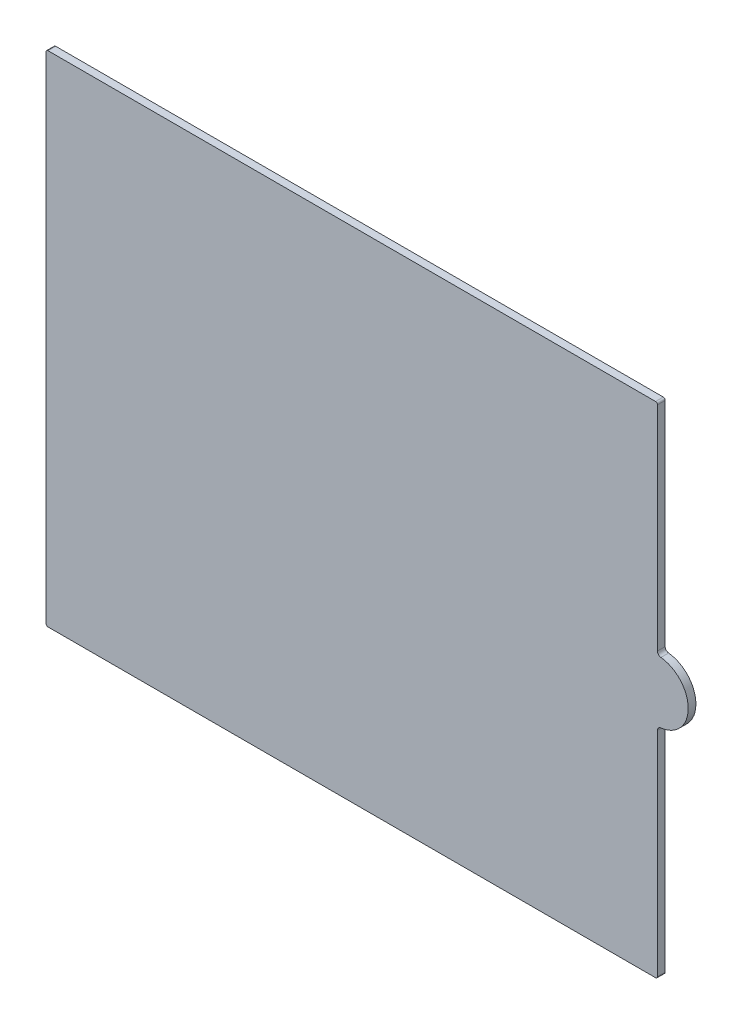
ISO-10303-21;
HEADER;
FILE_DESCRIPTION(('STEP AP214'),'2;1');
FILE_NAME('part.step','',(''),(''),'','','');
FILE_SCHEMA(('AUTOMOTIVE_DESIGN { 1 0 10303 214 1 1 1 1 }'));
ENDSEC;
DATA;
#1=APPLICATION_CONTEXT('core data for automotive mechanical design processes');
#2=APPLICATION_PROTOCOL_DEFINITION('international standard','automotive_design',2000,#1);
#3=PRODUCT_CONTEXT('',#1,'mechanical');
#4=PRODUCT('Part','Part','',(#3));
#5=PRODUCT_RELATED_PRODUCT_CATEGORY('part','',(#4));
#6=PRODUCT_DEFINITION_FORMATION('','',#4);
#7=PRODUCT_DEFINITION_CONTEXT('part definition',#1,'design');
#8=PRODUCT_DEFINITION('design','',#6,#7);
#9=PRODUCT_DEFINITION_SHAPE('','',#8);
#10=(LENGTH_UNIT() NAMED_UNIT(*) SI_UNIT(.MILLI.,.METRE.));
#11=(NAMED_UNIT(*) PLANE_ANGLE_UNIT() SI_UNIT($,.RADIAN.));
#12=(NAMED_UNIT(*) SI_UNIT($,.STERADIAN.) SOLID_ANGLE_UNIT());
#13=UNCERTAINTY_MEASURE_WITH_UNIT(LENGTH_MEASURE(1.E-05),#10,'distance_accuracy_value','');
#14=(GEOMETRIC_REPRESENTATION_CONTEXT(3) GLOBAL_UNCERTAINTY_ASSIGNED_CONTEXT((#13)) GLOBAL_UNIT_ASSIGNED_CONTEXT((#10,
#11,#12)) REPRESENTATION_CONTEXT('',''));
#15=CARTESIAN_POINT('',(0.,0.,0.));
#16=DIRECTION('',(0.,0.,1.));
#17=DIRECTION('',(1.,0.,0.));
#18=AXIS2_PLACEMENT_3D('',#15,#16,#17);
#19=CARTESIAN_POINT('',(252.73,103.1494,3.175));
#20=DIRECTION('',(0.,0.,-1.));
#21=DIRECTION('',(-1.,0.,0.));
#22=AXIS2_PLACEMENT_3D('',#19,#20,#21);
#23=CYLINDRICAL_SURFACE('',#22,12.7);
#24=CARTESIAN_POINT('',(252.73,103.1494,3.175));
#25=DIRECTION('',(0.,0.,1.));
#26=DIRECTION('',(1.,0.,0.));
#27=AXIS2_PLACEMENT_3D('',#24,#25,#26);
#28=CIRCLE('',#27,12.7);
#29=CARTESIAN_POINT('',(254.141111111111,90.5280385270012,3.175));
#30=VERTEX_POINT('',#29);
#31=CARTESIAN_POINT('',(254.141111111111,115.770761472999,3.175));
#32=VERTEX_POINT('',#31);
#33=EDGE_CURVE('E156',#30,#32,#28,.T.);
#34=ORIENTED_EDGE('',*,*,#33,.F.);
#35=DIRECTION('',(0.,0.,-1.));
#36=VECTOR('',#35,1.);
#37=CARTESIAN_POINT('',(254.141111111111,90.5280385270012,3.175));
#38=LINE('',#37,#36);
#39=CARTESIAN_POINT('',(254.141111111111,90.5280385270012,0.));
#40=VERTEX_POINT('',#39);
#41=EDGE_CURVE('E213',#30,#40,#38,.T.);
#42=ORIENTED_EDGE('',*,*,#41,.T.);
#43=CARTESIAN_POINT('',(252.73,103.1494,0.));
#44=DIRECTION('',(0.,0.,1.));
#45=DIRECTION('',(1.,0.,0.));
#46=AXIS2_PLACEMENT_3D('',#43,#44,#45);
#47=CIRCLE('',#46,12.7);
#48=CARTESIAN_POINT('',(254.141111111111,115.770761472999,0.));
#49=VERTEX_POINT('',#48);
#50=EDGE_CURVE('E230',#40,#49,#47,.T.);
#51=ORIENTED_EDGE('',*,*,#50,.T.);
#52=DIRECTION('',(0.,0.,-1.));
#53=VECTOR('',#52,1.);
#54=CARTESIAN_POINT('',(254.141111111111,115.770761472999,3.175));
#55=LINE('',#54,#53);
#56=EDGE_CURVE('E210',#49,#32,#55,.F.);
#57=ORIENTED_EDGE('',*,*,#56,.T.);
#58=EDGE_LOOP('',(#34,#42,#51,#57));
#59=FACE_BOUND('',#58,.T.);
#60=ADVANCED_FACE('F38',(#59),#23,.T.);
#61=CARTESIAN_POINT('',(252.73,115.8494,3.175));
#62=DIRECTION('',(-1.,0.,0.));
#63=DIRECTION('',(0.,0.,1.));
#64=AXIS2_PLACEMENT_3D('',#61,#62,#63);
#65=PLANE('',#64);
#66=DIRECTION('',(0.,1.,0.));
#67=VECTOR('',#66,1.);
#68=CARTESIAN_POINT('',(252.73,115.8494,3.175));
#69=LINE('',#68,#67);
#70=CARTESIAN_POINT('',(252.73,117.348431657124,3.175));
#71=VERTEX_POINT('',#70);
#72=CARTESIAN_POINT('',(252.73,205.50505,3.175));
#73=VERTEX_POINT('',#72);
#74=EDGE_CURVE('E161',#71,#73,#69,.T.);
#75=ORIENTED_EDGE('',*,*,#74,.F.);
#76=DIRECTION('',(0.,0.,1.));
#77=VECTOR('',#76,1.);
#78=CARTESIAN_POINT('',(252.73,117.348431657124,0.));
#79=LINE('',#78,#77);
#80=CARTESIAN_POINT('',(252.73,117.348431657124,0.));
#81=VERTEX_POINT('',#80);
#82=EDGE_CURVE('E220',#71,#81,#79,.F.);
#83=ORIENTED_EDGE('',*,*,#82,.T.);
#84=DIRECTION('',(0.,1.,0.));
#85=VECTOR('',#84,1.);
#86=CARTESIAN_POINT('',(252.73,115.8494,0.));
#87=LINE('',#86,#85);
#88=CARTESIAN_POINT('',(252.73,205.50505,0.));
#89=VERTEX_POINT('',#88);
#90=EDGE_CURVE('E231',#81,#89,#87,.T.);
#91=ORIENTED_EDGE('',*,*,#90,.T.);
#92=DIRECTION('',(0.,0.,-1.));
#93=VECTOR('',#92,1.);
#94=CARTESIAN_POINT('',(252.73,205.50505,3.175));
#95=LINE('',#94,#93);
#96=EDGE_CURVE('E206',#89,#73,#95,.F.);
#97=ORIENTED_EDGE('',*,*,#96,.T.);
#98=EDGE_LOOP('',(#75,#83,#91,#97));
#99=FACE_BOUND('',#98,.T.);
#100=ADVANCED_FACE('F238',(#99),#65,.F.);
#101=CARTESIAN_POINT('',(252.73,206.2988,3.175));
#102=DIRECTION('',(0.,-1.,0.));
#103=DIRECTION('',(1.,0.,0.));
#104=AXIS2_PLACEMENT_3D('',#101,#102,#103);
#105=PLANE('',#104);
#106=DIRECTION('',(-1.,0.,0.));
#107=VECTOR('',#106,1.);
#108=CARTESIAN_POINT('',(252.73,206.2988,0.));
#109=LINE('',#108,#107);
#110=CARTESIAN_POINT('',(251.93625,206.2988,0.));
#111=VERTEX_POINT('',#110);
#112=CARTESIAN_POINT('',(0.793749999999982,206.2988,0.));
#113=VERTEX_POINT('',#112);
#114=EDGE_CURVE('E260',#111,#113,#109,.T.);
#115=ORIENTED_EDGE('',*,*,#114,.T.);
#116=DIRECTION('',(0.,0.,-1.));
#117=VECTOR('',#116,1.);
#118=CARTESIAN_POINT('',(0.793749999999982,206.2988,3.175));
#119=LINE('',#118,#117);
#120=CARTESIAN_POINT('',(0.793749999999982,206.2988,3.175));
#121=VERTEX_POINT('',#120);
#122=EDGE_CURVE('E203',#113,#121,#119,.F.);
#123=ORIENTED_EDGE('',*,*,#122,.T.);
#124=DIRECTION('',(-1.,0.,0.));
#125=VECTOR('',#124,1.);
#126=CARTESIAN_POINT('',(252.73,206.2988,3.175));
#127=LINE('',#126,#125);
#128=CARTESIAN_POINT('',(251.93625,206.2988,3.175));
#129=VERTEX_POINT('',#128);
#130=EDGE_CURVE('E242',#129,#121,#127,.T.);
#131=ORIENTED_EDGE('',*,*,#130,.F.);
#132=DIRECTION('',(0.,0.,-1.));
#133=VECTOR('',#132,1.);
#134=CARTESIAN_POINT('',(251.93625,206.2988,3.175));
#135=LINE('',#134,#133);
#136=EDGE_CURVE('E199',#129,#111,#135,.T.);
#137=ORIENTED_EDGE('',*,*,#136,.T.);
#138=EDGE_LOOP('',(#115,#123,#131,#137));
#139=FACE_BOUND('',#138,.T.);
#140=ADVANCED_FACE('F286',(#139),#105,.F.);
#141=CARTESIAN_POINT('',(0.,206.2988,3.175));
#142=DIRECTION('',(1.,0.,0.));
#143=DIRECTION('',(0.,0.,-1.));
#144=AXIS2_PLACEMENT_3D('',#141,#142,#143);
#145=PLANE('',#144);
#146=DIRECTION('',(0.,-1.,0.));
#147=VECTOR('',#146,1.);
#148=CARTESIAN_POINT('',(0.,206.2988,0.));
#149=LINE('',#148,#147);
#150=CARTESIAN_POINT('',(0.,205.50505,0.));
#151=VERTEX_POINT('',#150);
#152=CARTESIAN_POINT('',(0.,0.79375000000001,0.));
#153=VERTEX_POINT('',#152);
#154=EDGE_CURVE('E163',#151,#153,#149,.T.);
#155=ORIENTED_EDGE('',*,*,#154,.T.);
#156=DIRECTION('',(0.,0.,-1.));
#157=VECTOR('',#156,1.);
#158=CARTESIAN_POINT('',(0.,0.79375000000001,3.175));
#159=LINE('',#158,#157);
#160=CARTESIAN_POINT('',(0.,0.79375000000001,3.175));
#161=VERTEX_POINT('',#160);
#162=EDGE_CURVE('E196',#153,#161,#159,.F.);
#163=ORIENTED_EDGE('',*,*,#162,.T.);
#164=DIRECTION('',(0.,-1.,0.));
#165=VECTOR('',#164,1.);
#166=CARTESIAN_POINT('',(0.,206.2988,3.175));
#167=LINE('',#166,#165);
#168=CARTESIAN_POINT('',(0.,205.50505,3.175));
#169=VERTEX_POINT('',#168);
#170=EDGE_CURVE('E246',#169,#161,#167,.T.);
#171=ORIENTED_EDGE('',*,*,#170,.F.);
#172=DIRECTION('',(0.,0.,-1.));
#173=VECTOR('',#172,1.);
#174=CARTESIAN_POINT('',(0.,205.50505,3.175));
#175=LINE('',#174,#173);
#176=EDGE_CURVE('E192',#169,#151,#175,.T.);
#177=ORIENTED_EDGE('',*,*,#176,.T.);
#178=EDGE_LOOP('',(#155,#163,#171,#177));
#179=FACE_BOUND('',#178,.T.);
#180=ADVANCED_FACE('F268',(#179),#145,.F.);
#181=CARTESIAN_POINT('',(0.,0.,3.175));
#182=DIRECTION('',(0.,1.,0.));
#183=DIRECTION('',(0.,0.,1.));
#184=AXIS2_PLACEMENT_3D('',#181,#182,#183);
#185=PLANE('',#184);
#186=DIRECTION('',(1.,0.,0.));
#187=VECTOR('',#186,1.);
#188=CARTESIAN_POINT('',(0.,0.,0.));
#189=LINE('',#188,#187);
#190=CARTESIAN_POINT('',(0.79375,0.,0.));
#191=VERTEX_POINT('',#190);
#192=CARTESIAN_POINT('',(251.93625,0.,0.));
#193=VERTEX_POINT('',#192);
#194=EDGE_CURVE('E157',#191,#193,#189,.T.);
#195=ORIENTED_EDGE('',*,*,#194,.T.);
#196=DIRECTION('',(0.,0.,-1.));
#197=VECTOR('',#196,1.);
#198=CARTESIAN_POINT('',(251.93625,0.,3.175));
#199=LINE('',#198,#197);
#200=CARTESIAN_POINT('',(251.93625,0.,3.175));
#201=VERTEX_POINT('',#200);
#202=EDGE_CURVE('E132',#193,#201,#199,.F.);
#203=ORIENTED_EDGE('',*,*,#202,.T.);
#204=DIRECTION('',(1.,0.,0.));
#205=VECTOR('',#204,1.);
#206=CARTESIAN_POINT('',(0.,0.,3.175));
#207=LINE('',#206,#205);
#208=CARTESIAN_POINT('',(0.79375,0.,3.175));
#209=VERTEX_POINT('',#208);
#210=EDGE_CURVE('E252',#209,#201,#207,.T.);
#211=ORIENTED_EDGE('',*,*,#210,.F.);
#212=DIRECTION('',(0.,0.,-1.));
#213=VECTOR('',#212,1.);
#214=CARTESIAN_POINT('',(0.79375,0.,3.175));
#215=LINE('',#214,#213);
#216=EDGE_CURVE('E138',#209,#191,#215,.T.);
#217=ORIENTED_EDGE('',*,*,#216,.T.);
#218=EDGE_LOOP('',(#195,#203,#211,#217));
#219=FACE_BOUND('',#218,.T.);
#220=ADVANCED_FACE('F278',(#219),#185,.F.);
#221=CARTESIAN_POINT('',(252.73,0.,3.175));
#222=DIRECTION('',(-1.,0.,0.));
#223=DIRECTION('',(0.,0.,1.));
#224=AXIS2_PLACEMENT_3D('',#221,#222,#223);
#225=PLANE('',#224);
#226=DIRECTION('',(0.,1.,0.));
#227=VECTOR('',#226,1.);
#228=CARTESIAN_POINT('',(252.73,0.,0.));
#229=LINE('',#228,#227);
#230=CARTESIAN_POINT('',(252.73,0.79375,0.));
#231=VERTEX_POINT('',#230);
#232=CARTESIAN_POINT('',(252.73,88.9503683428764,0.));
#233=VERTEX_POINT('',#232);
#234=EDGE_CURVE('E145',#231,#233,#229,.T.);
#235=ORIENTED_EDGE('',*,*,#234,.T.);
#236=DIRECTION('',(0.,0.,1.));
#237=VECTOR('',#236,1.);
#238=CARTESIAN_POINT('',(252.73,88.9503683428764,3.175));
#239=LINE('',#238,#237);
#240=CARTESIAN_POINT('',(252.73,88.9503683428764,3.175));
#241=VERTEX_POINT('',#240);
#242=EDGE_CURVE('E217',#233,#241,#239,.T.);
#243=ORIENTED_EDGE('',*,*,#242,.T.);
#244=DIRECTION('',(0.,1.,0.));
#245=VECTOR('',#244,1.);
#246=CARTESIAN_POINT('',(252.73,0.,3.175));
#247=LINE('',#246,#245);
#248=CARTESIAN_POINT('',(252.73,0.79375,3.175));
#249=VERTEX_POINT('',#248);
#250=EDGE_CURVE('E148',#249,#241,#247,.T.);
#251=ORIENTED_EDGE('',*,*,#250,.F.);
#252=DIRECTION('',(0.,0.,-1.));
#253=VECTOR('',#252,1.);
#254=CARTESIAN_POINT('',(252.73,0.79375,3.175));
#255=LINE('',#254,#253);
#256=EDGE_CURVE('E131',#249,#231,#255,.T.);
#257=ORIENTED_EDGE('',*,*,#256,.T.);
#258=EDGE_LOOP('',(#235,#243,#251,#257));
#259=FACE_BOUND('',#258,.T.);
#260=ADVANCED_FACE('F144',(#259),#225,.F.);
#261=CARTESIAN_POINT('',(252.73,103.1494,3.175));
#262=DIRECTION('',(0.,0.,1.));
#263=DIRECTION('',(1.,0.,0.));
#264=AXIS2_PLACEMENT_3D('',#261,#262,#263);
#265=PLANE('',#264);
#266=ORIENTED_EDGE('',*,*,#210,.T.);
#267=CARTESIAN_POINT('',(251.93625,0.79375,3.175));
#268=DIRECTION('',(0.,0.,1.));
#269=DIRECTION('',(1.,0.,0.));
#270=AXIS2_PLACEMENT_3D('',#267,#268,#269);
#271=CIRCLE('',#270,0.79375);
#272=EDGE_CURVE('E189',#201,#249,#271,.T.);
#273=ORIENTED_EDGE('',*,*,#272,.T.);
#274=ORIENTED_EDGE('',*,*,#250,.T.);
#275=CARTESIAN_POINT('',(254.3175,88.9503683428764,3.175));
#276=DIRECTION('',(0.,0.,1.));
#277=DIRECTION('',(1.,0.,0.));
#278=AXIS2_PLACEMENT_3D('',#275,#276,#277);
#279=CIRCLE('',#278,1.5875);
#280=EDGE_CURVE('E225',#241,#30,#279,.F.);
#281=ORIENTED_EDGE('',*,*,#280,.T.);
#282=ORIENTED_EDGE('',*,*,#33,.T.);
#283=CARTESIAN_POINT('',(254.3175,117.348431657124,3.175));
#284=DIRECTION('',(0.,0.,1.));
#285=DIRECTION('',(1.,0.,0.));
#286=AXIS2_PLACEMENT_3D('',#283,#284,#285);
#287=CIRCLE('',#286,1.5875);
#288=EDGE_CURVE('E11',#32,#71,#287,.F.);
#289=ORIENTED_EDGE('',*,*,#288,.T.);
#290=ORIENTED_EDGE('',*,*,#74,.T.);
#291=CARTESIAN_POINT('',(251.93625,205.50505,3.175));
#292=DIRECTION('',(0.,0.,1.));
#293=DIRECTION('',(1.,0.,0.));
#294=AXIS2_PLACEMENT_3D('',#291,#292,#293);
#295=CIRCLE('',#294,0.79375);
#296=EDGE_CURVE('E180',#73,#129,#295,.T.);
#297=ORIENTED_EDGE('',*,*,#296,.T.);
#298=ORIENTED_EDGE('',*,*,#130,.T.);
#299=CARTESIAN_POINT('',(0.79375,205.50505,3.175));
#300=DIRECTION('',(0.,0.,1.));
#301=DIRECTION('',(1.,0.,0.));
#302=AXIS2_PLACEMENT_3D('',#299,#300,#301);
#303=CIRCLE('',#302,0.79375);
#304=EDGE_CURVE('E183',#121,#169,#303,.T.);
#305=ORIENTED_EDGE('',*,*,#304,.T.);
#306=ORIENTED_EDGE('',*,*,#170,.T.);
#307=CARTESIAN_POINT('',(0.79375,0.79375,3.175));
#308=DIRECTION('',(0.,0.,1.));
#309=DIRECTION('',(1.,0.,0.));
#310=AXIS2_PLACEMENT_3D('',#307,#308,#309);
#311=CIRCLE('',#310,0.79375);
#312=EDGE_CURVE('E186',#161,#209,#311,.T.);
#313=ORIENTED_EDGE('',*,*,#312,.T.);
#314=EDGE_LOOP('',(#266,#273,#274,#281,#282,#289,#290,#297,#298,#305,#306,#313));
#315=FACE_BOUND('',#314,.T.);
#316=ADVANCED_FACE('F276',(#315),#265,.T.);
#317=CARTESIAN_POINT('',(252.73,103.1494,0.));
#318=DIRECTION('',(0.,0.,1.));
#319=DIRECTION('',(1.,0.,0.));
#320=AXIS2_PLACEMENT_3D('',#317,#318,#319);
#321=PLANE('',#320);
#322=ORIENTED_EDGE('',*,*,#234,.F.);
#323=CARTESIAN_POINT('',(251.93625,0.79375,0.));
#324=DIRECTION('',(0.,0.,1.));
#325=DIRECTION('',(1.,0.,0.));
#326=AXIS2_PLACEMENT_3D('',#323,#324,#325);
#327=CIRCLE('',#326,0.79375);
#328=EDGE_CURVE('E127',#231,#193,#327,.F.);
#329=ORIENTED_EDGE('',*,*,#328,.T.);
#330=ORIENTED_EDGE('',*,*,#194,.F.);
#331=CARTESIAN_POINT('',(0.79375,0.79375,0.));
#332=DIRECTION('',(0.,0.,1.));
#333=DIRECTION('',(1.,0.,0.));
#334=AXIS2_PLACEMENT_3D('',#331,#332,#333);
#335=CIRCLE('',#334,0.79375);
#336=EDGE_CURVE('E139',#191,#153,#335,.F.);
#337=ORIENTED_EDGE('',*,*,#336,.T.);
#338=ORIENTED_EDGE('',*,*,#154,.F.);
#339=CARTESIAN_POINT('',(0.79375,205.50505,0.));
#340=DIRECTION('',(0.,0.,1.));
#341=DIRECTION('',(1.,0.,0.));
#342=AXIS2_PLACEMENT_3D('',#339,#340,#341);
#343=CIRCLE('',#342,0.79375);
#344=EDGE_CURVE('E170',#151,#113,#343,.F.);
#345=ORIENTED_EDGE('',*,*,#344,.T.);
#346=ORIENTED_EDGE('',*,*,#114,.F.);
#347=CARTESIAN_POINT('',(251.93625,205.50505,0.));
#348=DIRECTION('',(0.,0.,1.));
#349=DIRECTION('',(1.,0.,0.));
#350=AXIS2_PLACEMENT_3D('',#347,#348,#349);
#351=CIRCLE('',#350,0.79375);
#352=EDGE_CURVE('E150',#111,#89,#351,.F.);
#353=ORIENTED_EDGE('',*,*,#352,.T.);
#354=ORIENTED_EDGE('',*,*,#90,.F.);
#355=CARTESIAN_POINT('',(254.3175,117.348431657124,0.));
#356=DIRECTION('',(0.,0.,1.));
#357=DIRECTION('',(1.,0.,0.));
#358=AXIS2_PLACEMENT_3D('',#355,#356,#357);
#359=CIRCLE('',#358,1.5875);
#360=EDGE_CURVE('E47',#81,#49,#359,.T.);
#361=ORIENTED_EDGE('',*,*,#360,.T.);
#362=ORIENTED_EDGE('',*,*,#50,.F.);
#363=CARTESIAN_POINT('',(254.3175,88.9503683428764,0.));
#364=DIRECTION('',(0.,0.,1.));
#365=DIRECTION('',(1.,0.,0.));
#366=AXIS2_PLACEMENT_3D('',#363,#364,#365);
#367=CIRCLE('',#366,1.5875);
#368=EDGE_CURVE('E154',#40,#233,#367,.T.);
#369=ORIENTED_EDGE('',*,*,#368,.T.);
#370=EDGE_LOOP('',(#322,#329,#330,#337,#338,#345,#346,#353,#354,#361,#362,#369));
#371=FACE_BOUND('',#370,.T.);
#372=ADVANCED_FACE('F152',(#371),#321,.F.);
#373=CARTESIAN_POINT('',(251.93625,0.79375,3.175));
#374=DIRECTION('',(0.,0.,-1.));
#375=DIRECTION('',(-1.,0.,0.));
#376=AXIS2_PLACEMENT_3D('',#373,#374,#375);
#377=CYLINDRICAL_SURFACE('',#376,0.79375);
#378=ORIENTED_EDGE('',*,*,#272,.F.);
#379=ORIENTED_EDGE('',*,*,#202,.F.);
#380=ORIENTED_EDGE('',*,*,#328,.F.);
#381=ORIENTED_EDGE('',*,*,#256,.F.);
#382=EDGE_LOOP('',(#378,#379,#380,#381));
#383=FACE_BOUND('',#382,.T.);
#384=ADVANCED_FACE('F130',(#383),#377,.T.);
#385=CARTESIAN_POINT('',(0.79375,0.79375,3.175));
#386=DIRECTION('',(0.,0.,-1.));
#387=DIRECTION('',(-1.,0.,0.));
#388=AXIS2_PLACEMENT_3D('',#385,#386,#387);
#389=CYLINDRICAL_SURFACE('',#388,0.79375);
#390=ORIENTED_EDGE('',*,*,#312,.F.);
#391=ORIENTED_EDGE('',*,*,#162,.F.);
#392=ORIENTED_EDGE('',*,*,#336,.F.);
#393=ORIENTED_EDGE('',*,*,#216,.F.);
#394=EDGE_LOOP('',(#390,#391,#392,#393));
#395=FACE_BOUND('',#394,.T.);
#396=ADVANCED_FACE('F273',(#395),#389,.T.);
#397=CARTESIAN_POINT('',(0.79375,205.50505,3.175));
#398=DIRECTION('',(0.,0.,-1.));
#399=DIRECTION('',(-1.,0.,0.));
#400=AXIS2_PLACEMENT_3D('',#397,#398,#399);
#401=CYLINDRICAL_SURFACE('',#400,0.79375);
#402=ORIENTED_EDGE('',*,*,#304,.F.);
#403=ORIENTED_EDGE('',*,*,#122,.F.);
#404=ORIENTED_EDGE('',*,*,#344,.F.);
#405=ORIENTED_EDGE('',*,*,#176,.F.);
#406=EDGE_LOOP('',(#402,#403,#404,#405));
#407=FACE_BOUND('',#406,.T.);
#408=ADVANCED_FACE('F300',(#407),#401,.T.);
#409=CARTESIAN_POINT('',(251.93625,205.50505,3.175));
#410=DIRECTION('',(0.,0.,-1.));
#411=DIRECTION('',(-1.,0.,0.));
#412=AXIS2_PLACEMENT_3D('',#409,#410,#411);
#413=CYLINDRICAL_SURFACE('',#412,0.79375);
#414=ORIENTED_EDGE('',*,*,#296,.F.);
#415=ORIENTED_EDGE('',*,*,#96,.F.);
#416=ORIENTED_EDGE('',*,*,#352,.F.);
#417=ORIENTED_EDGE('',*,*,#136,.F.);
#418=EDGE_LOOP('',(#414,#415,#416,#417));
#419=FACE_BOUND('',#418,.T.);
#420=ADVANCED_FACE('F303',(#419),#413,.T.);
#421=CARTESIAN_POINT('',(254.3175,88.9503683428764,3.175));
#422=DIRECTION('',(0.,0.,-1.));
#423=DIRECTION('',(-1.,0.,0.));
#424=AXIS2_PLACEMENT_3D('',#421,#422,#423);
#425=CYLINDRICAL_SURFACE('',#424,1.5875);
#426=ORIENTED_EDGE('',*,*,#280,.F.);
#427=ORIENTED_EDGE('',*,*,#242,.F.);
#428=ORIENTED_EDGE('',*,*,#368,.F.);
#429=ORIENTED_EDGE('',*,*,#41,.F.);
#430=EDGE_LOOP('',(#426,#427,#428,#429));
#431=FACE_BOUND('',#430,.T.);
#432=ADVANCED_FACE('F306',(#431),#425,.F.);
#433=CARTESIAN_POINT('',(254.3175,117.348431657124,3.175));
#434=DIRECTION('',(0.,0.,-1.));
#435=DIRECTION('',(-1.,0.,0.));
#436=AXIS2_PLACEMENT_3D('',#433,#434,#435);
#437=CYLINDRICAL_SURFACE('',#436,1.5875);
#438=ORIENTED_EDGE('',*,*,#288,.F.);
#439=ORIENTED_EDGE('',*,*,#56,.F.);
#440=ORIENTED_EDGE('',*,*,#360,.F.);
#441=ORIENTED_EDGE('',*,*,#82,.F.);
#442=EDGE_LOOP('',(#438,#439,#440,#441));
#443=FACE_BOUND('',#442,.T.);
#444=ADVANCED_FACE('F40',(#443),#437,.F.);
#445=CLOSED_SHELL('',(#60,#100,#140,#180,#220,#260,#316,#372,#384,#396,#408,#420,#432,#444));
#446=MANIFOLD_SOLID_BREP('B2',#445);
#447=ADVANCED_BREP_SHAPE_REPRESENTATION('',(#18,#446),#14);
#448=SHAPE_DEFINITION_REPRESENTATION(#9,#447);
ENDSEC;
END-ISO-10303-21;
